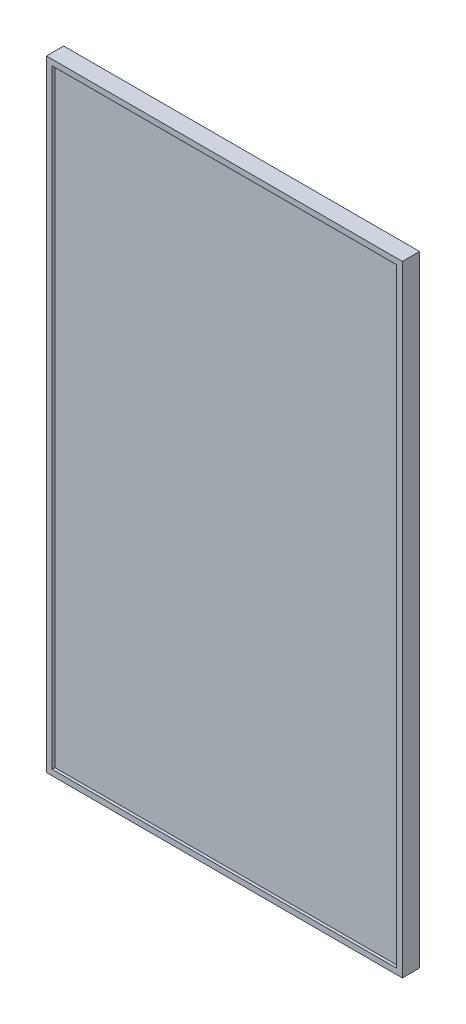
ISO-10303-21;
HEADER;
FILE_DESCRIPTION(('STEP AP214'),'2;1');
FILE_NAME('part.step','',(''),(''),'','','');
FILE_SCHEMA(('AUTOMOTIVE_DESIGN { 1 0 10303 214 1 1 1 1 }'));
ENDSEC;
DATA;
#1=APPLICATION_CONTEXT('core data for automotive mechanical design processes');
#2=APPLICATION_PROTOCOL_DEFINITION('international standard','automotive_design',2000,#1);
#3=PRODUCT_CONTEXT('',#1,'mechanical');
#4=PRODUCT('Part','Part','',(#3));
#5=PRODUCT_RELATED_PRODUCT_CATEGORY('part','',(#4));
#6=PRODUCT_DEFINITION_FORMATION('','',#4);
#7=PRODUCT_DEFINITION_CONTEXT('part definition',#1,'design');
#8=PRODUCT_DEFINITION('design','',#6,#7);
#9=PRODUCT_DEFINITION_SHAPE('','',#8);
#10=(LENGTH_UNIT() NAMED_UNIT(*) SI_UNIT(.MILLI.,.METRE.));
#11=(NAMED_UNIT(*) PLANE_ANGLE_UNIT() SI_UNIT($,.RADIAN.));
#12=(NAMED_UNIT(*) SI_UNIT($,.STERADIAN.) SOLID_ANGLE_UNIT());
#13=UNCERTAINTY_MEASURE_WITH_UNIT(LENGTH_MEASURE(1.E-05),#10,'distance_accuracy_value','');
#14=(GEOMETRIC_REPRESENTATION_CONTEXT(3) GLOBAL_UNCERTAINTY_ASSIGNED_CONTEXT((#13)) GLOBAL_UNIT_ASSIGNED_CONTEXT((#10,
#11,#12)) REPRESENTATION_CONTEXT('',''));
#15=CARTESIAN_POINT('',(0.,0.,0.));
#16=DIRECTION('',(0.,0.,1.));
#17=DIRECTION('',(1.,0.,0.));
#18=AXIS2_PLACEMENT_3D('',#15,#16,#17);
#19=CARTESIAN_POINT('',(314.55,-548.45,30.5));
#20=DIRECTION('',(-1.,0.,0.));
#21=DIRECTION('',(0.,0.,1.));
#22=AXIS2_PLACEMENT_3D('',#19,#20,#21);
#23=PLANE('',#22);
#24=DIRECTION('',(0.,1.,0.));
#25=VECTOR('',#24,1.);
#26=CARTESIAN_POINT('',(314.55,-548.45,0.));
#27=LINE('',#26,#25);
#28=CARTESIAN_POINT('',(314.55,-548.45,0.));
#29=VERTEX_POINT('',#28);
#30=CARTESIAN_POINT('',(314.55,548.45,0.));
#31=VERTEX_POINT('',#30);
#32=EDGE_CURVE('E166',#29,#31,#27,.T.);
#33=ORIENTED_EDGE('',*,*,#32,.T.);
#34=DIRECTION('',(0.,0.,-1.));
#35=VECTOR('',#34,1.);
#36=CARTESIAN_POINT('',(314.55,548.45,30.5));
#37=LINE('',#36,#35);
#38=CARTESIAN_POINT('',(314.55,548.45,30.5));
#39=VERTEX_POINT('',#38);
#40=EDGE_CURVE('E11',#39,#31,#37,.T.);
#41=ORIENTED_EDGE('',*,*,#40,.F.);
#42=DIRECTION('',(0.,1.,0.));
#43=VECTOR('',#42,1.);
#44=CARTESIAN_POINT('',(314.55,-548.45,30.5));
#45=LINE('',#44,#43);
#46=CARTESIAN_POINT('',(314.55,-548.45,30.5));
#47=VERTEX_POINT('',#46);
#48=EDGE_CURVE('E169',#47,#39,#45,.T.);
#49=ORIENTED_EDGE('',*,*,#48,.F.);
#50=DIRECTION('',(0.,0.,-1.));
#51=VECTOR('',#50,1.);
#52=CARTESIAN_POINT('',(314.55,-548.45,30.5));
#53=LINE('',#52,#51);
#54=EDGE_CURVE('E175',#47,#29,#53,.T.);
#55=ORIENTED_EDGE('',*,*,#54,.T.);
#56=EDGE_LOOP('',(#33,#41,#49,#55));
#57=FACE_BOUND('',#56,.T.);
#58=ADVANCED_FACE('F33',(#57),#23,.F.);
#59=CARTESIAN_POINT('',(-314.55,548.45,30.5));
#60=DIRECTION('',(0.,-1.,0.));
#61=DIRECTION('',(0.,0.,-1.));
#62=AXIS2_PLACEMENT_3D('',#59,#60,#61);
#63=PLANE('',#62);
#64=DIRECTION('',(-1.,0.,0.));
#65=VECTOR('',#64,1.);
#66=CARTESIAN_POINT('',(-314.55,548.45,0.));
#67=LINE('',#66,#65);
#68=CARTESIAN_POINT('',(-314.55,548.45,0.));
#69=VERTEX_POINT('',#68);
#70=EDGE_CURVE('E178',#31,#69,#67,.T.);
#71=ORIENTED_EDGE('',*,*,#70,.T.);
#72=DIRECTION('',(0.,0.,-1.));
#73=VECTOR('',#72,1.);
#74=CARTESIAN_POINT('',(-314.55,548.45,30.5));
#75=LINE('',#74,#73);
#76=CARTESIAN_POINT('',(-314.55,548.45,30.5));
#77=VERTEX_POINT('',#76);
#78=EDGE_CURVE('E40',#77,#69,#75,.T.);
#79=ORIENTED_EDGE('',*,*,#78,.F.);
#80=DIRECTION('',(-1.,0.,0.));
#81=VECTOR('',#80,1.);
#82=CARTESIAN_POINT('',(-314.55,548.45,30.5));
#83=LINE('',#82,#81);
#84=EDGE_CURVE('E84',#39,#77,#83,.T.);
#85=ORIENTED_EDGE('',*,*,#84,.F.);
#86=ORIENTED_EDGE('',*,*,#40,.T.);
#87=EDGE_LOOP('',(#71,#79,#85,#86));
#88=FACE_BOUND('',#87,.T.);
#89=ADVANCED_FACE('F207',(#88),#63,.F.);
#90=CARTESIAN_POINT('',(-314.55,-548.45,30.5));
#91=DIRECTION('',(1.,0.,0.));
#92=DIRECTION('',(0.,0.,-1.));
#93=AXIS2_PLACEMENT_3D('',#90,#91,#92);
#94=PLANE('',#93);
#95=DIRECTION('',(0.,-1.,0.));
#96=VECTOR('',#95,1.);
#97=CARTESIAN_POINT('',(-314.55,-548.45,0.));
#98=LINE('',#97,#96);
#99=CARTESIAN_POINT('',(-314.55,-548.45,0.));
#100=VERTEX_POINT('',#99);
#101=EDGE_CURVE('E180',#69,#100,#98,.T.);
#102=ORIENTED_EDGE('',*,*,#101,.T.);
#103=DIRECTION('',(0.,0.,-1.));
#104=VECTOR('',#103,1.);
#105=CARTESIAN_POINT('',(-314.55,-548.45,30.5));
#106=LINE('',#105,#104);
#107=CARTESIAN_POINT('',(-314.55,-548.45,30.5));
#108=VERTEX_POINT('',#107);
#109=EDGE_CURVE('E184',#108,#100,#106,.T.);
#110=ORIENTED_EDGE('',*,*,#109,.F.);
#111=DIRECTION('',(0.,-1.,0.));
#112=VECTOR('',#111,1.);
#113=CARTESIAN_POINT('',(-314.55,-548.45,30.5));
#114=LINE('',#113,#112);
#115=EDGE_CURVE('E172',#77,#108,#114,.T.);
#116=ORIENTED_EDGE('',*,*,#115,.F.);
#117=ORIENTED_EDGE('',*,*,#78,.T.);
#118=EDGE_LOOP('',(#102,#110,#116,#117));
#119=FACE_BOUND('',#118,.T.);
#120=ADVANCED_FACE('F189',(#119),#94,.F.);
#121=CARTESIAN_POINT('',(-314.55,-548.45,30.5));
#122=DIRECTION('',(0.,1.,0.));
#123=DIRECTION('',(0.,0.,1.));
#124=AXIS2_PLACEMENT_3D('',#121,#122,#123);
#125=PLANE('',#124);
#126=DIRECTION('',(1.,0.,0.));
#127=VECTOR('',#126,1.);
#128=CARTESIAN_POINT('',(-314.55,-548.45,0.));
#129=LINE('',#128,#127);
#130=EDGE_CURVE('E77',#100,#29,#129,.T.);
#131=ORIENTED_EDGE('',*,*,#130,.T.);
#132=ORIENTED_EDGE('',*,*,#54,.F.);
#133=DIRECTION('',(1.,0.,0.));
#134=VECTOR('',#133,1.);
#135=CARTESIAN_POINT('',(-314.55,-548.45,30.5));
#136=LINE('',#135,#134);
#137=EDGE_CURVE('E56',#108,#47,#136,.T.);
#138=ORIENTED_EDGE('',*,*,#137,.F.);
#139=ORIENTED_EDGE('',*,*,#109,.T.);
#140=EDGE_LOOP('',(#131,#132,#138,#139));
#141=FACE_BOUND('',#140,.T.);
#142=ADVANCED_FACE('F197',(#141),#125,.F.);
#143=CARTESIAN_POINT('',(0.,0.,30.5));
#144=DIRECTION('',(0.,0.,-1.));
#145=DIRECTION('',(-1.,0.,0.));
#146=AXIS2_PLACEMENT_3D('',#143,#144,#145);
#147=PLANE('',#146);
#148=DIRECTION('',(1.,0.,0.));
#149=VECTOR('',#148,1.);
#150=CARTESIAN_POINT('',(304.55,-538.45,30.5));
#151=LINE('',#150,#149);
#152=CARTESIAN_POINT('',(-304.55,-538.45,30.5));
#153=VERTEX_POINT('',#152);
#154=CARTESIAN_POINT('',(304.55,-538.45,30.5));
#155=VERTEX_POINT('',#154);
#156=EDGE_CURVE('E135',#153,#155,#151,.T.);
#157=ORIENTED_EDGE('',*,*,#156,.F.);
#158=DIRECTION('',(0.,-1.,0.));
#159=VECTOR('',#158,1.);
#160=CARTESIAN_POINT('',(-304.55,-538.45,30.5));
#161=LINE('',#160,#159);
#162=CARTESIAN_POINT('',(-304.55,538.45,30.5));
#163=VERTEX_POINT('',#162);
#164=EDGE_CURVE('E47',#163,#153,#161,.T.);
#165=ORIENTED_EDGE('',*,*,#164,.F.);
#166=DIRECTION('',(-1.,0.,0.));
#167=VECTOR('',#166,1.);
#168=CARTESIAN_POINT('',(304.55,538.45,30.5));
#169=LINE('',#168,#167);
#170=CARTESIAN_POINT('',(304.55,538.45,30.5));
#171=VERTEX_POINT('',#170);
#172=EDGE_CURVE('E126',#171,#163,#169,.T.);
#173=ORIENTED_EDGE('',*,*,#172,.F.);
#174=DIRECTION('',(0.,1.,0.));
#175=VECTOR('',#174,1.);
#176=CARTESIAN_POINT('',(304.55,-538.45,30.5));
#177=LINE('',#176,#175);
#178=EDGE_CURVE('E129',#155,#171,#177,.T.);
#179=ORIENTED_EDGE('',*,*,#178,.F.);
#180=EDGE_LOOP('',(#157,#165,#173,#179));
#181=FACE_BOUND('',#180,.T.);
#182=ORIENTED_EDGE('',*,*,#48,.T.);
#183=ORIENTED_EDGE('',*,*,#84,.T.);
#184=ORIENTED_EDGE('',*,*,#115,.T.);
#185=ORIENTED_EDGE('',*,*,#137,.T.);
#186=EDGE_LOOP('',(#182,#183,#184,#185));
#187=FACE_BOUND('',#186,.T.);
#188=ADVANCED_FACE('F199',(#181,#187),#147,.F.);
#189=CARTESIAN_POINT('',(0.,0.,0.));
#190=DIRECTION('',(0.,0.,-1.));
#191=DIRECTION('',(-1.,0.,0.));
#192=AXIS2_PLACEMENT_3D('',#189,#190,#191);
#193=PLANE('',#192);
#194=CARTESIAN_POINT('',(200.,-200.,0.));
#195=DIRECTION('',(0.,0.,-1.));
#196=DIRECTION('',(-1.,0.,0.));
#197=AXIS2_PLACEMENT_3D('',#194,#195,#196);
#198=CIRCLE('',#197,3.99999999999999);
#199=CARTESIAN_POINT('',(196.,-200.,0.));
#200=VERTEX_POINT('',#199);
#201=EDGE_CURVE('E141',#200,#200,#198,.T.);
#202=ORIENTED_EDGE('',*,*,#201,.F.);
#203=EDGE_LOOP('',(#202));
#204=FACE_BOUND('',#203,.T.);
#205=CARTESIAN_POINT('',(-200.,-200.,0.));
#206=DIRECTION('',(0.,0.,-1.));
#207=DIRECTION('',(-1.,0.,0.));
#208=AXIS2_PLACEMENT_3D('',#205,#206,#207);
#209=CIRCLE('',#208,3.99999999999999);
#210=CARTESIAN_POINT('',(-204.,-200.,0.));
#211=VERTEX_POINT('',#210);
#212=EDGE_CURVE('E155',#211,#211,#209,.T.);
#213=ORIENTED_EDGE('',*,*,#212,.F.);
#214=EDGE_LOOP('',(#213));
#215=FACE_BOUND('',#214,.T.);
#216=CARTESIAN_POINT('',(-200.,200.,0.));
#217=DIRECTION('',(0.,0.,-1.));
#218=DIRECTION('',(-1.,0.,0.));
#219=AXIS2_PLACEMENT_3D('',#216,#217,#218);
#220=CIRCLE('',#219,3.99999999999999);
#221=CARTESIAN_POINT('',(-204.,200.,0.));
#222=VERTEX_POINT('',#221);
#223=EDGE_CURVE('E149',#222,#222,#220,.T.);
#224=ORIENTED_EDGE('',*,*,#223,.F.);
#225=EDGE_LOOP('',(#224));
#226=FACE_BOUND('',#225,.T.);
#227=CARTESIAN_POINT('',(200.,200.,0.));
#228=DIRECTION('',(0.,0.,-1.));
#229=DIRECTION('',(-1.,0.,0.));
#230=AXIS2_PLACEMENT_3D('',#227,#228,#229);
#231=CIRCLE('',#230,3.99999999999999);
#232=CARTESIAN_POINT('',(196.,200.,0.));
#233=VERTEX_POINT('',#232);
#234=EDGE_CURVE('E148',#233,#233,#231,.T.);
#235=ORIENTED_EDGE('',*,*,#234,.F.);
#236=EDGE_LOOP('',(#235));
#237=FACE_BOUND('',#236,.T.);
#238=ORIENTED_EDGE('',*,*,#32,.F.);
#239=ORIENTED_EDGE('',*,*,#130,.F.);
#240=ORIENTED_EDGE('',*,*,#101,.F.);
#241=ORIENTED_EDGE('',*,*,#70,.F.);
#242=EDGE_LOOP('',(#238,#239,#240,#241));
#243=FACE_BOUND('',#242,.T.);
#244=ADVANCED_FACE('F193',(#204,#215,#226,#237,#243),#193,.T.);
#245=CARTESIAN_POINT('',(200.,200.,21.));
#246=DIRECTION('',(0.,0.,-1.));
#247=DIRECTION('',(-1.,0.,0.));
#248=AXIS2_PLACEMENT_3D('',#245,#246,#247);
#249=CYLINDRICAL_SURFACE('',#248,3.99999999999999);
#250=CARTESIAN_POINT('',(200.,200.,21.));
#251=DIRECTION('',(0.,0.,-1.));
#252=DIRECTION('',(-1.,0.,0.));
#253=AXIS2_PLACEMENT_3D('',#250,#251,#252);
#254=CIRCLE('',#253,3.99999999999999);
#255=CARTESIAN_POINT('',(196.,200.,21.));
#256=VERTEX_POINT('',#255);
#257=EDGE_CURVE('E163',#256,#256,#254,.T.);
#258=ORIENTED_EDGE('',*,*,#257,.F.);
#259=EDGE_LOOP('',(#258));
#260=FACE_BOUND('',#259,.T.);
#261=ORIENTED_EDGE('',*,*,#234,.T.);
#262=EDGE_LOOP('',(#261));
#263=FACE_BOUND('',#262,.T.);
#264=ADVANCED_FACE('F234',(#260,#263),#249,.F.);
#265=CARTESIAN_POINT('',(200.,200.,21.));
#266=DIRECTION('',(0.,0.,-1.));
#267=DIRECTION('',(-1.,0.,0.));
#268=AXIS2_PLACEMENT_3D('',#265,#266,#267);
#269=PLANE('',#268);
#270=ORIENTED_EDGE('',*,*,#257,.T.);
#271=EDGE_LOOP('',(#270));
#272=FACE_BOUND('',#271,.T.);
#273=ADVANCED_FACE('F243',(#272),#269,.T.);
#274=CARTESIAN_POINT('',(-200.,200.,21.));
#275=DIRECTION('',(0.,0.,-1.));
#276=DIRECTION('',(-1.,0.,0.));
#277=AXIS2_PLACEMENT_3D('',#274,#275,#276);
#278=CYLINDRICAL_SURFACE('',#277,3.99999999999999);
#279=CARTESIAN_POINT('',(-200.,200.,21.));
#280=DIRECTION('',(0.,0.,-1.));
#281=DIRECTION('',(-1.,0.,0.));
#282=AXIS2_PLACEMENT_3D('',#279,#280,#281);
#283=CIRCLE('',#282,3.99999999999999);
#284=CARTESIAN_POINT('',(-204.,200.,21.));
#285=VERTEX_POINT('',#284);
#286=EDGE_CURVE('E145',#285,#285,#283,.T.);
#287=ORIENTED_EDGE('',*,*,#286,.F.);
#288=EDGE_LOOP('',(#287));
#289=FACE_BOUND('',#288,.T.);
#290=ORIENTED_EDGE('',*,*,#223,.T.);
#291=EDGE_LOOP('',(#290));
#292=FACE_BOUND('',#291,.T.);
#293=ADVANCED_FACE('F253',(#289,#292),#278,.F.);
#294=CARTESIAN_POINT('',(-200.,200.,21.));
#295=DIRECTION('',(0.,0.,-1.));
#296=DIRECTION('',(-1.,0.,0.));
#297=AXIS2_PLACEMENT_3D('',#294,#295,#296);
#298=PLANE('',#297);
#299=ORIENTED_EDGE('',*,*,#286,.T.);
#300=EDGE_LOOP('',(#299));
#301=FACE_BOUND('',#300,.T.);
#302=ADVANCED_FACE('F263',(#301),#298,.T.);
#303=CARTESIAN_POINT('',(-200.,-200.,21.));
#304=DIRECTION('',(0.,0.,-1.));
#305=DIRECTION('',(-1.,0.,0.));
#306=AXIS2_PLACEMENT_3D('',#303,#304,#305);
#307=CYLINDRICAL_SURFACE('',#306,3.99999999999999);
#308=CARTESIAN_POINT('',(-200.,-200.,21.));
#309=DIRECTION('',(0.,0.,-1.));
#310=DIRECTION('',(-1.,0.,0.));
#311=AXIS2_PLACEMENT_3D('',#308,#309,#310);
#312=CIRCLE('',#311,3.99999999999999);
#313=CARTESIAN_POINT('',(-204.,-200.,21.));
#314=VERTEX_POINT('',#313);
#315=EDGE_CURVE('E152',#314,#314,#312,.T.);
#316=ORIENTED_EDGE('',*,*,#315,.F.);
#317=EDGE_LOOP('',(#316));
#318=FACE_BOUND('',#317,.T.);
#319=ORIENTED_EDGE('',*,*,#212,.T.);
#320=EDGE_LOOP('',(#319));
#321=FACE_BOUND('',#320,.T.);
#322=ADVANCED_FACE('F273',(#318,#321),#307,.F.);
#323=CARTESIAN_POINT('',(-200.,-200.,21.));
#324=DIRECTION('',(0.,0.,-1.));
#325=DIRECTION('',(-1.,0.,0.));
#326=AXIS2_PLACEMENT_3D('',#323,#324,#325);
#327=PLANE('',#326);
#328=ORIENTED_EDGE('',*,*,#315,.T.);
#329=EDGE_LOOP('',(#328));
#330=FACE_BOUND('',#329,.T.);
#331=ADVANCED_FACE('F283',(#330),#327,.T.);
#332=CARTESIAN_POINT('',(200.,-200.,21.));
#333=DIRECTION('',(0.,0.,-1.));
#334=DIRECTION('',(-1.,0.,0.));
#335=AXIS2_PLACEMENT_3D('',#332,#333,#334);
#336=CYLINDRICAL_SURFACE('',#335,3.99999999999999);
#337=CARTESIAN_POINT('',(200.,-200.,21.));
#338=DIRECTION('',(0.,0.,-1.));
#339=DIRECTION('',(-1.,0.,0.));
#340=AXIS2_PLACEMENT_3D('',#337,#338,#339);
#341=CIRCLE('',#340,3.99999999999999);
#342=CARTESIAN_POINT('',(196.,-200.,21.));
#343=VERTEX_POINT('',#342);
#344=EDGE_CURVE('E158',#343,#343,#341,.T.);
#345=ORIENTED_EDGE('',*,*,#344,.F.);
#346=EDGE_LOOP('',(#345));
#347=FACE_BOUND('',#346,.T.);
#348=ORIENTED_EDGE('',*,*,#201,.T.);
#349=EDGE_LOOP('',(#348));
#350=FACE_BOUND('',#349,.T.);
#351=ADVANCED_FACE('F293',(#347,#350),#336,.F.);
#352=CARTESIAN_POINT('',(200.,-200.,21.));
#353=DIRECTION('',(0.,0.,-1.));
#354=DIRECTION('',(-1.,0.,0.));
#355=AXIS2_PLACEMENT_3D('',#352,#353,#354);
#356=PLANE('',#355);
#357=ORIENTED_EDGE('',*,*,#344,.T.);
#358=EDGE_LOOP('',(#357));
#359=FACE_BOUND('',#358,.T.);
#360=ADVANCED_FACE('F303',(#359),#356,.T.);
#361=CARTESIAN_POINT('',(-304.55,-538.45,25.5));
#362=DIRECTION('',(-1.,0.,0.));
#363=DIRECTION('',(0.,0.,1.));
#364=AXIS2_PLACEMENT_3D('',#361,#362,#363);
#365=PLANE('',#364);
#366=ORIENTED_EDGE('',*,*,#164,.T.);
#367=DIRECTION('',(0.,0.,1.));
#368=VECTOR('',#367,1.);
#369=CARTESIAN_POINT('',(-304.55,-538.45,25.5));
#370=LINE('',#369,#368);
#371=CARTESIAN_POINT('',(-304.55,-538.45,25.5));
#372=VERTEX_POINT('',#371);
#373=EDGE_CURVE('E104',#372,#153,#370,.T.);
#374=ORIENTED_EDGE('',*,*,#373,.F.);
#375=DIRECTION('',(0.,-1.,0.));
#376=VECTOR('',#375,1.);
#377=CARTESIAN_POINT('',(-304.55,-538.45,25.5));
#378=LINE('',#377,#376);
#379=CARTESIAN_POINT('',(-304.55,538.45,25.5));
#380=VERTEX_POINT('',#379);
#381=EDGE_CURVE('E108',#380,#372,#378,.T.);
#382=ORIENTED_EDGE('',*,*,#381,.F.);
#383=DIRECTION('',(0.,0.,1.));
#384=VECTOR('',#383,1.);
#385=CARTESIAN_POINT('',(-304.55,538.45,25.5));
#386=LINE('',#385,#384);
#387=EDGE_CURVE('E139',#380,#163,#386,.T.);
#388=ORIENTED_EDGE('',*,*,#387,.T.);
#389=EDGE_LOOP('',(#366,#374,#382,#388));
#390=FACE_BOUND('',#389,.T.);
#391=ADVANCED_FACE('F106',(#390),#365,.F.);
#392=CARTESIAN_POINT('',(304.55,538.45,25.5));
#393=DIRECTION('',(0.,1.,0.));
#394=DIRECTION('',(0.,0.,1.));
#395=AXIS2_PLACEMENT_3D('',#392,#393,#394);
#396=PLANE('',#395);
#397=ORIENTED_EDGE('',*,*,#172,.T.);
#398=ORIENTED_EDGE('',*,*,#387,.F.);
#399=DIRECTION('',(-1.,0.,0.));
#400=VECTOR('',#399,1.);
#401=CARTESIAN_POINT('',(304.55,538.45,25.5));
#402=LINE('',#401,#400);
#403=CARTESIAN_POINT('',(304.55,538.45,25.5));
#404=VERTEX_POINT('',#403);
#405=EDGE_CURVE('E114',#404,#380,#402,.T.);
#406=ORIENTED_EDGE('',*,*,#405,.F.);
#407=DIRECTION('',(0.,0.,1.));
#408=VECTOR('',#407,1.);
#409=CARTESIAN_POINT('',(304.55,538.45,25.5));
#410=LINE('',#409,#408);
#411=EDGE_CURVE('E142',#404,#171,#410,.T.);
#412=ORIENTED_EDGE('',*,*,#411,.T.);
#413=EDGE_LOOP('',(#397,#398,#406,#412));
#414=FACE_BOUND('',#413,.T.);
#415=ADVANCED_FACE('F327',(#414),#396,.F.);
#416=CARTESIAN_POINT('',(304.55,-538.45,25.5));
#417=DIRECTION('',(1.,0.,0.));
#418=DIRECTION('',(0.,0.,-1.));
#419=AXIS2_PLACEMENT_3D('',#416,#417,#418);
#420=PLANE('',#419);
#421=ORIENTED_EDGE('',*,*,#178,.T.);
#422=ORIENTED_EDGE('',*,*,#411,.F.);
#423=DIRECTION('',(0.,1.,0.));
#424=VECTOR('',#423,1.);
#425=CARTESIAN_POINT('',(304.55,-538.45,25.5));
#426=LINE('',#425,#424);
#427=CARTESIAN_POINT('',(304.55,-538.45,25.5));
#428=VERTEX_POINT('',#427);
#429=EDGE_CURVE('E122',#428,#404,#426,.T.);
#430=ORIENTED_EDGE('',*,*,#429,.F.);
#431=DIRECTION('',(0.,0.,1.));
#432=VECTOR('',#431,1.);
#433=CARTESIAN_POINT('',(304.55,-538.45,25.5));
#434=LINE('',#433,#432);
#435=EDGE_CURVE('E113',#428,#155,#434,.T.);
#436=ORIENTED_EDGE('',*,*,#435,.T.);
#437=EDGE_LOOP('',(#421,#422,#430,#436));
#438=FACE_BOUND('',#437,.T.);
#439=ADVANCED_FACE('F336',(#438),#420,.F.);
#440=CARTESIAN_POINT('',(304.55,-538.45,25.5));
#441=DIRECTION('',(0.,-1.,0.));
#442=DIRECTION('',(0.,0.,-1.));
#443=AXIS2_PLACEMENT_3D('',#440,#441,#442);
#444=PLANE('',#443);
#445=ORIENTED_EDGE('',*,*,#156,.T.);
#446=ORIENTED_EDGE('',*,*,#435,.F.);
#447=DIRECTION('',(1.,0.,0.));
#448=VECTOR('',#447,1.);
#449=CARTESIAN_POINT('',(304.55,-538.45,25.5));
#450=LINE('',#449,#448);
#451=EDGE_CURVE('E117',#372,#428,#450,.T.);
#452=ORIENTED_EDGE('',*,*,#451,.F.);
#453=ORIENTED_EDGE('',*,*,#373,.T.);
#454=EDGE_LOOP('',(#445,#446,#452,#453));
#455=FACE_BOUND('',#454,.T.);
#456=ADVANCED_FACE('F118',(#455),#444,.F.);
#457=CARTESIAN_POINT('',(0.,0.,25.5));
#458=DIRECTION('',(0.,0.,1.));
#459=DIRECTION('',(1.,0.,0.));
#460=AXIS2_PLACEMENT_3D('',#457,#458,#459);
#461=PLANE('',#460);
#462=ORIENTED_EDGE('',*,*,#381,.T.);
#463=ORIENTED_EDGE('',*,*,#451,.T.);
#464=ORIENTED_EDGE('',*,*,#429,.T.);
#465=ORIENTED_EDGE('',*,*,#405,.T.);
#466=EDGE_LOOP('',(#462,#463,#464,#465));
#467=FACE_BOUND('',#466,.T.);
#468=ADVANCED_FACE('F124',(#467),#461,.T.);
#469=CLOSED_SHELL('',(#58,#89,#120,#142,#188,#244,#264,#273,#293,#302,#322,#331,#351,#360,#391,
#415,#439,#456,#468));
#470=MANIFOLD_SOLID_BREP('B2',#469);
#471=ADVANCED_BREP_SHAPE_REPRESENTATION('',(#18,#470),#14);
#472=SHAPE_DEFINITION_REPRESENTATION(#9,#471);
ENDSEC;
END-ISO-10303-21;
